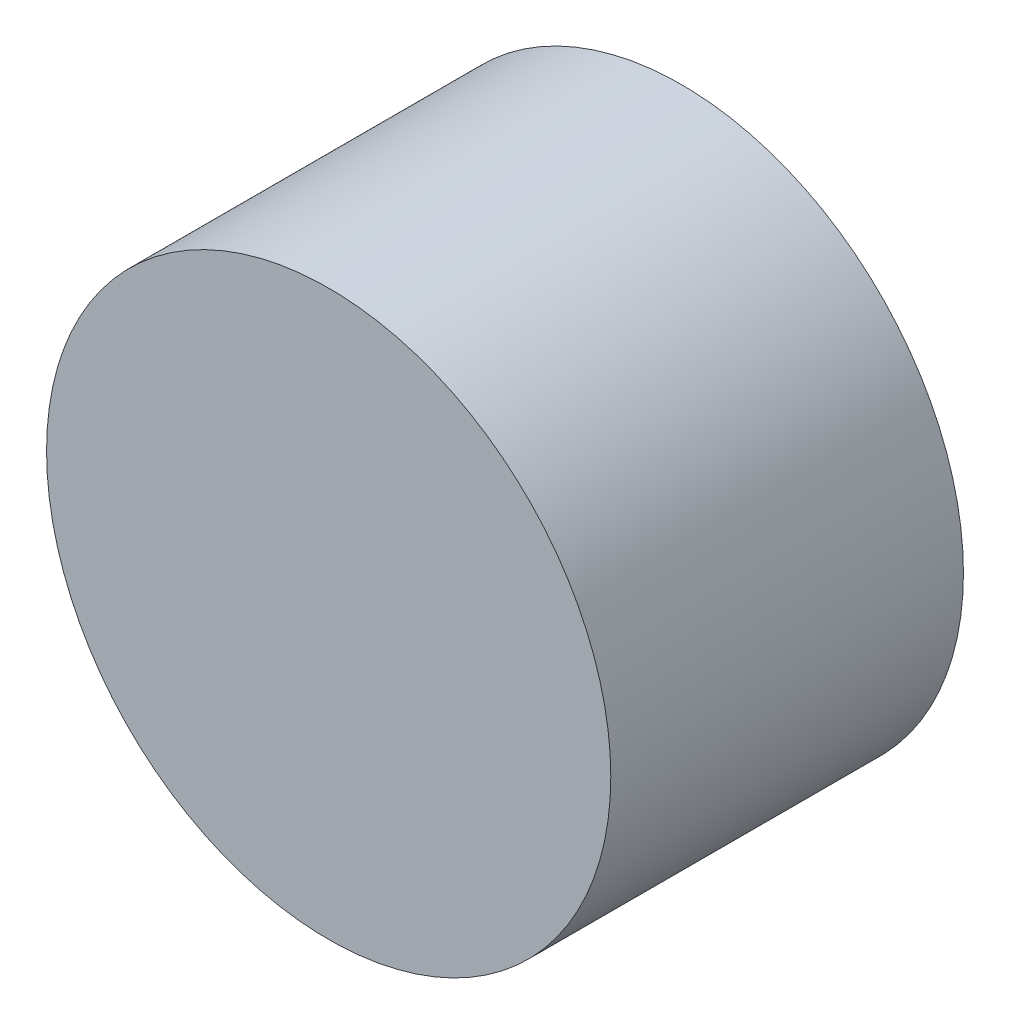
ISO-10303-21;
HEADER;
FILE_DESCRIPTION(('STEP AP214'),'2;1');
FILE_NAME('part.step','',(''),(''),'','','');
FILE_SCHEMA(('AUTOMOTIVE_DESIGN { 1 0 10303 214 1 1 1 1 }'));
ENDSEC;
DATA;
#1=APPLICATION_CONTEXT('core data for automotive mechanical design processes');
#2=APPLICATION_PROTOCOL_DEFINITION('international standard','automotive_design',2000,#1);
#3=PRODUCT_CONTEXT('',#1,'mechanical');
#4=PRODUCT('Part','Part','',(#3));
#5=PRODUCT_RELATED_PRODUCT_CATEGORY('part','',(#4));
#6=PRODUCT_DEFINITION_FORMATION('','',#4);
#7=PRODUCT_DEFINITION_CONTEXT('part definition',#1,'design');
#8=PRODUCT_DEFINITION('design','',#6,#7);
#9=PRODUCT_DEFINITION_SHAPE('','',#8);
#10=(LENGTH_UNIT() NAMED_UNIT(*) SI_UNIT(.MILLI.,.METRE.));
#11=(NAMED_UNIT(*) PLANE_ANGLE_UNIT() SI_UNIT($,.RADIAN.));
#12=(NAMED_UNIT(*) SI_UNIT($,.STERADIAN.) SOLID_ANGLE_UNIT());
#13=UNCERTAINTY_MEASURE_WITH_UNIT(LENGTH_MEASURE(1.E-05),#10,'distance_accuracy_value','');
#14=(GEOMETRIC_REPRESENTATION_CONTEXT(3) GLOBAL_UNCERTAINTY_ASSIGNED_CONTEXT((#13)) GLOBAL_UNIT_ASSIGNED_CONTEXT((#10,
#11,#12)) REPRESENTATION_CONTEXT('',''));
#15=CARTESIAN_POINT('',(0.,0.,0.));
#16=DIRECTION('',(0.,0.,1.));
#17=DIRECTION('',(1.,0.,0.));
#18=AXIS2_PLACEMENT_3D('',#15,#16,#17);
#19=CARTESIAN_POINT('',(0.,0.,31.75));
#20=DIRECTION('',(0.,0.,-1.));
#21=DIRECTION('',(-1.,0.,0.));
#22=AXIS2_PLACEMENT_3D('',#19,#20,#21);
#23=CYLINDRICAL_SURFACE('',#22,25.4);
#24=CARTESIAN_POINT('',(0.,0.,31.75));
#25=DIRECTION('',(0.,0.,1.));
#26=DIRECTION('',(1.,0.,0.));
#27=AXIS2_PLACEMENT_3D('',#24,#25,#26);
#28=CIRCLE('',#27,25.4);
#29=CARTESIAN_POINT('',(25.4,0.,31.75));
#30=VERTEX_POINT('',#29);
#31=EDGE_CURVE('E10',#30,#30,#28,.T.);
#32=ORIENTED_EDGE('',*,*,#31,.F.);
#33=EDGE_LOOP('',(#32));
#34=FACE_BOUND('',#33,.T.);
#35=CARTESIAN_POINT('',(0.,0.,0.));
#36=DIRECTION('',(0.,0.,1.));
#37=DIRECTION('',(1.,0.,0.));
#38=AXIS2_PLACEMENT_3D('',#35,#36,#37);
#39=CIRCLE('',#38,25.4);
#40=CARTESIAN_POINT('',(25.4,0.,0.));
#41=VERTEX_POINT('',#40);
#42=EDGE_CURVE('E38',#41,#41,#39,.T.);
#43=ORIENTED_EDGE('',*,*,#42,.T.);
#44=EDGE_LOOP('',(#43));
#45=FACE_BOUND('',#44,.T.);
#46=ADVANCED_FACE('F35',(#34,#45),#23,.T.);
#47=CARTESIAN_POINT('',(0.,0.,31.75));
#48=DIRECTION('',(0.,0.,1.));
#49=DIRECTION('',(1.,0.,0.));
#50=AXIS2_PLACEMENT_3D('',#47,#48,#49);
#51=PLANE('',#50);
#52=ORIENTED_EDGE('',*,*,#31,.T.);
#53=EDGE_LOOP('',(#52));
#54=FACE_BOUND('',#53,.T.);
#55=ADVANCED_FACE('F50',(#54),#51,.T.);
#56=CARTESIAN_POINT('',(0.,0.,0.));
#57=DIRECTION('',(0.,0.,1.));
#58=DIRECTION('',(1.,0.,0.));
#59=AXIS2_PLACEMENT_3D('',#56,#57,#58);
#60=PLANE('',#59);
#61=ORIENTED_EDGE('',*,*,#42,.F.);
#62=EDGE_LOOP('',(#61));
#63=FACE_BOUND('',#62,.T.);
#64=ADVANCED_FACE('F48',(#63),#60,.F.);
#65=CLOSED_SHELL('',(#46,#55,#64));
#66=MANIFOLD_SOLID_BREP('B2',#65);
#67=ADVANCED_BREP_SHAPE_REPRESENTATION('',(#18,#66),#14);
#68=SHAPE_DEFINITION_REPRESENTATION(#9,#67);
ENDSEC;
END-ISO-10303-21;
